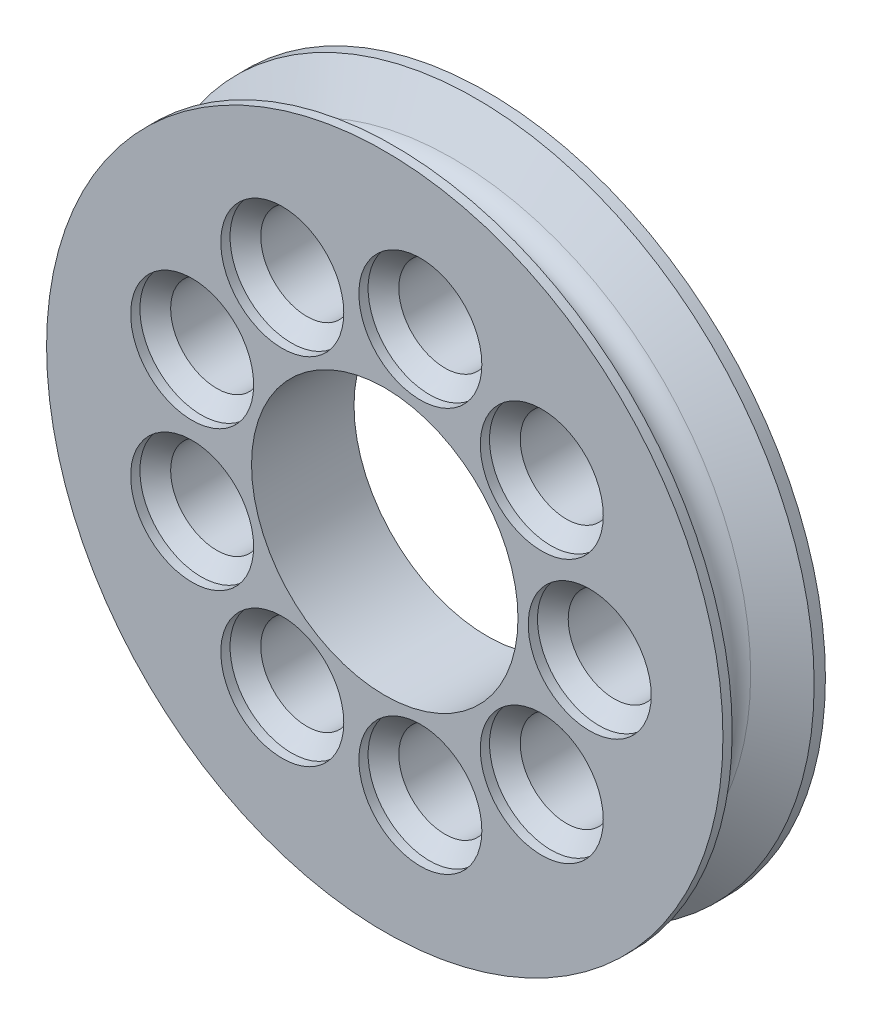
ISO-10303-21;
HEADER;
FILE_DESCRIPTION(('STEP AP214'),'2;1');
FILE_NAME('part.step','',(''),(''),'','','');
FILE_SCHEMA(('AUTOMOTIVE_DESIGN { 1 0 10303 214 1 1 1 1 }'));
ENDSEC;
DATA;
#1=APPLICATION_CONTEXT('core data for automotive mechanical design processes');
#2=APPLICATION_PROTOCOL_DEFINITION('international standard','automotive_design',2000,#1);
#3=PRODUCT_CONTEXT('',#1,'mechanical');
#4=PRODUCT('Part','Part','',(#3));
#5=PRODUCT_RELATED_PRODUCT_CATEGORY('part','',(#4));
#6=PRODUCT_DEFINITION_FORMATION('','',#4);
#7=PRODUCT_DEFINITION_CONTEXT('part definition',#1,'design');
#8=PRODUCT_DEFINITION('design','',#6,#7);
#9=PRODUCT_DEFINITION_SHAPE('','',#8);
#10=(LENGTH_UNIT() NAMED_UNIT(*) SI_UNIT(.MILLI.,.METRE.));
#11=(NAMED_UNIT(*) PLANE_ANGLE_UNIT() SI_UNIT($,.RADIAN.));
#12=(NAMED_UNIT(*) SI_UNIT($,.STERADIAN.) SOLID_ANGLE_UNIT());
#13=UNCERTAINTY_MEASURE_WITH_UNIT(LENGTH_MEASURE(1.E-05),#10,'distance_accuracy_value','');
#14=(GEOMETRIC_REPRESENTATION_CONTEXT(3) GLOBAL_UNCERTAINTY_ASSIGNED_CONTEXT((#13)) GLOBAL_UNIT_ASSIGNED_CONTEXT((#10,
#11,#12)) REPRESENTATION_CONTEXT('',''));
#15=CARTESIAN_POINT('',(0.,0.,0.));
#16=DIRECTION('',(0.,0.,1.));
#17=DIRECTION('',(1.,0.,0.));
#18=AXIS2_PLACEMENT_3D('',#15,#16,#17);
#19=CARTESIAN_POINT('',(41.91,0.,-11.5553001664477));
#20=DIRECTION('',(0.,0.,-1.));
#21=DIRECTION('',(-1.,0.,0.));
#22=AXIS2_PLACEMENT_3D('',#19,#20,#21);
#23=CYLINDRICAL_SURFACE('',#22,41.91);
#24=CARTESIAN_POINT('',(41.91,0.,1.14469983355232));
#25=DIRECTION('',(0.,0.,-1.));
#26=DIRECTION('',(-1.,0.,0.));
#27=AXIS2_PLACEMENT_3D('',#24,#25,#26);
#28=CIRCLE('',#27,41.91);
#29=CARTESIAN_POINT('',(0.,0.,1.14469983355232));
#30=VERTEX_POINT('',#29);
#31=EDGE_CURVE('E135',#30,#30,#28,.T.);
#32=ORIENTED_EDGE('',*,*,#31,.T.);
#33=EDGE_LOOP('',(#32));
#34=FACE_BOUND('',#33,.T.);
#35=CARTESIAN_POINT('',(41.91,0.,0.));
#36=DIRECTION('',(0.,0.,-1.));
#37=DIRECTION('',(-1.,0.,0.));
#38=AXIS2_PLACEMENT_3D('',#35,#36,#37);
#39=CIRCLE('',#38,41.91);
#40=CARTESIAN_POINT('',(0.,0.,0.));
#41=VERTEX_POINT('',#40);
#42=EDGE_CURVE('E10',#41,#41,#39,.T.);
#43=ORIENTED_EDGE('',*,*,#42,.F.);
#44=EDGE_LOOP('',(#43));
#45=FACE_BOUND('',#44,.T.);
#46=ADVANCED_FACE('F36',(#34,#45),#23,.T.);
#47=CARTESIAN_POINT('',(41.91,0.,-2.88029547438751));
#48=DIRECTION('',(0.,0.,1.));
#49=DIRECTION('',(1.,0.,0.));
#50=AXIS2_PLACEMENT_3D('',#47,#48,#49);
#51=CONICAL_SURFACE('',#50,36.9211818975501,1.0471975511966);
#52=ORIENTED_EDGE('',*,*,#42,.T.);
#53=EDGE_LOOP('',(#52));
#54=FACE_BOUND('',#53,.T.);
#55=CARTESIAN_POINT('',(41.91,0.,-2.88029547438751));
#56=DIRECTION('',(0.,0.,-1.));
#57=DIRECTION('',(-1.,0.,0.));
#58=AXIS2_PLACEMENT_3D('',#55,#56,#57);
#59=CIRCLE('',#58,36.9211818975501);
#60=CARTESIAN_POINT('',(4.98881810244987,0.,-2.88029547438751));
#61=VERTEX_POINT('',#60);
#62=EDGE_CURVE('E44',#61,#61,#59,.T.);
#63=ORIENTED_EDGE('',*,*,#62,.F.);
#64=EDGE_LOOP('',(#63));
#65=FACE_BOUND('',#64,.T.);
#66=ADVANCED_FACE('F155',(#54,#65),#51,.T.);
#67=CARTESIAN_POINT('',(41.91,0.,-5.08));
#68=DIRECTION('',(0.,0.,-1.));
#69=DIRECTION('',(-1.,0.,0.));
#70=AXIS2_PLACEMENT_3D('',#67,#68,#69);
#71=TOROIDAL_SURFACE('',#70,38.1911818975501,2.53999999999999);
#72=ORIENTED_EDGE('',*,*,#62,.T.);
#73=EDGE_LOOP('',(#72));
#74=FACE_BOUND('',#73,.T.);
#75=CARTESIAN_POINT('',(41.91,0.,-7.27970452561247));
#76=DIRECTION('',(0.,0.,-1.));
#77=DIRECTION('',(-1.,0.,0.));
#78=AXIS2_PLACEMENT_3D('',#75,#76,#77);
#79=CIRCLE('',#78,36.9211818975501);
#80=CARTESIAN_POINT('',(4.98881810244989,0.,-7.27970452561247));
#81=VERTEX_POINT('',#80);
#82=EDGE_CURVE('E50',#81,#81,#79,.T.);
#83=ORIENTED_EDGE('',*,*,#82,.F.);
#84=EDGE_LOOP('',(#83));
#85=FACE_BOUND('',#84,.T.);
#86=ADVANCED_FACE('F153',(#74,#85),#71,.F.);
#87=CARTESIAN_POINT('',(41.91,0.,-10.16));
#88=DIRECTION('',(0.,0.,-1.));
#89=DIRECTION('',(-1.,0.,0.));
#90=AXIS2_PLACEMENT_3D('',#87,#88,#89);
#91=CONICAL_SURFACE('',#90,41.91,1.0471975511966);
#92=ORIENTED_EDGE('',*,*,#82,.T.);
#93=EDGE_LOOP('',(#92));
#94=FACE_BOUND('',#93,.T.);
#95=CARTESIAN_POINT('',(41.91,0.,-10.16));
#96=DIRECTION('',(0.,0.,-1.));
#97=DIRECTION('',(-1.,0.,0.));
#98=AXIS2_PLACEMENT_3D('',#95,#96,#97);
#99=CIRCLE('',#98,41.91);
#100=CARTESIAN_POINT('',(0.,0.,-10.16));
#101=VERTEX_POINT('',#100);
#102=EDGE_CURVE('E143',#101,#101,#99,.T.);
#103=ORIENTED_EDGE('',*,*,#102,.F.);
#104=EDGE_LOOP('',(#103));
#105=FACE_BOUND('',#104,.T.);
#106=ADVANCED_FACE('F150',(#94,#105),#91,.T.);
#107=CARTESIAN_POINT('',(41.91,0.,-11.5553001664477));
#108=DIRECTION('',(0.,0.,-1.));
#109=DIRECTION('',(-1.,0.,0.));
#110=AXIS2_PLACEMENT_3D('',#107,#108,#109);
#111=CYLINDRICAL_SURFACE('',#110,41.91);
#112=ORIENTED_EDGE('',*,*,#102,.T.);
#113=EDGE_LOOP('',(#112));
#114=FACE_BOUND('',#113,.T.);
#115=CARTESIAN_POINT('',(41.91,0.,-11.5553001664477));
#116=DIRECTION('',(0.,0.,-1.));
#117=DIRECTION('',(-1.,0.,0.));
#118=AXIS2_PLACEMENT_3D('',#115,#116,#117);
#119=CIRCLE('',#118,41.91);
#120=CARTESIAN_POINT('',(0.,0.,-11.5553001664477));
#121=VERTEX_POINT('',#120);
#122=EDGE_CURVE('E139',#121,#121,#119,.T.);
#123=ORIENTED_EDGE('',*,*,#122,.F.);
#124=EDGE_LOOP('',(#123));
#125=FACE_BOUND('',#124,.T.);
#126=ADVANCED_FACE('F162',(#114,#125),#111,.T.);
#127=CARTESIAN_POINT('',(0.,0.,-11.5553001664477));
#128=DIRECTION('',(0.,0.,-1.));
#129=DIRECTION('',(-1.,0.,0.));
#130=AXIS2_PLACEMENT_3D('',#127,#128,#129);
#131=PLANE('',#130);
#132=CARTESIAN_POINT('',(46.32066371274,-25.0141169265101,-11.5553001664477));
#133=DIRECTION('',(0.,0.,-1.));
#134=DIRECTION('',(-1.,0.,0.));
#135=AXIS2_PLACEMENT_3D('',#132,#133,#134);
#136=CIRCLE('',#135,7.62);
#137=CARTESIAN_POINT('',(38.70066371274,-25.0141169265101,-11.5553001664477));
#138=VERTEX_POINT('',#137);
#139=EDGE_CURVE('E585',#138,#138,#136,.T.);
#140=ORIENTED_EDGE('',*,*,#139,.F.);
#141=EDGE_LOOP('',(#140));
#142=FACE_BOUND('',#141,.T.);
#143=CARTESIAN_POINT('',(61.367528855222,-16.3268052860381,-11.5553001664477));
#144=DIRECTION('',(0.,0.,-1.));
#145=DIRECTION('',(-1.,0.,0.));
#146=AXIS2_PLACEMENT_3D('',#143,#144,#145);
#147=CIRCLE('',#146,7.62);
#148=CARTESIAN_POINT('',(53.747528855222,-16.3268052860381,-11.5553001664477));
#149=VERTEX_POINT('',#148);
#150=EDGE_CURVE('E579',#149,#149,#147,.T.);
#151=ORIENTED_EDGE('',*,*,#150,.F.);
#152=EDGE_LOOP('',(#151));
#153=FACE_BOUND('',#152,.T.);
#154=CARTESIAN_POINT('',(18.0418074320379,-8.68731164047199,-11.5553001664477));
#155=DIRECTION('',(0.,0.,-1.));
#156=DIRECTION('',(-1.,0.,0.));
#157=AXIS2_PLACEMENT_3D('',#154,#155,#156);
#158=CIRCLE('',#157,7.62);
#159=CARTESIAN_POINT('',(10.4218074320379,-8.68731164047199,-11.5553001664477));
#160=VERTEX_POINT('',#159);
#161=EDGE_CURVE('E606',#160,#160,#158,.T.);
#162=ORIENTED_EDGE('',*,*,#161,.F.);
#163=EDGE_LOOP('',(#162));
#164=FACE_BOUND('',#163,.T.);
#165=CARTESIAN_POINT('',(29.21,-21.9970452561247,-11.5553001664477));
#166=DIRECTION('',(0.,0.,-1.));
#167=DIRECTION('',(-1.,0.,0.));
#168=AXIS2_PLACEMENT_3D('',#165,#166,#167);
#169=CIRCLE('',#168,7.62);
#170=CARTESIAN_POINT('',(21.59,-21.9970452561247,-11.5553001664477));
#171=VERTEX_POINT('',#170);
#172=EDGE_CURVE('E610',#171,#171,#169,.T.);
#173=ORIENTED_EDGE('',*,*,#172,.F.);
#174=EDGE_LOOP('',(#173));
#175=FACE_BOUND('',#174,.T.);
#176=CARTESIAN_POINT('',(29.21,21.9970452561247,-11.5553001664477));
#177=DIRECTION('',(0.,0.,-1.));
#178=DIRECTION('',(-1.,0.,0.));
#179=AXIS2_PLACEMENT_3D('',#176,#177,#178);
#180=CIRCLE('',#179,7.61999999999999);
#181=CARTESIAN_POINT('',(21.59,21.9970452561247,-11.5553001664477));
#182=VERTEX_POINT('',#181);
#183=EDGE_CURVE('E597',#182,#182,#180,.T.);
#184=ORIENTED_EDGE('',*,*,#183,.F.);
#185=EDGE_LOOP('',(#184));
#186=FACE_BOUND('',#185,.T.);
#187=CARTESIAN_POINT('',(18.0418074320379,8.68731164047199,-11.5553001664477));
#188=DIRECTION('',(0.,0.,-1.));
#189=DIRECTION('',(-1.,0.,0.));
#190=AXIS2_PLACEMENT_3D('',#187,#188,#189);
#191=CIRCLE('',#190,7.62);
#192=CARTESIAN_POINT('',(10.4218074320379,8.68731164047199,-11.5553001664477));
#193=VERTEX_POINT('',#192);
#194=EDGE_CURVE('E602',#193,#193,#191,.T.);
#195=ORIENTED_EDGE('',*,*,#194,.F.);
#196=EDGE_LOOP('',(#195));
#197=FACE_BOUND('',#196,.T.);
#198=CARTESIAN_POINT('',(61.367528855222,16.3268052860381,-11.5553001664477));
#199=DIRECTION('',(0.,0.,-1.));
#200=DIRECTION('',(-1.,0.,0.));
#201=AXIS2_PLACEMENT_3D('',#198,#199,#200);
#202=CIRCLE('',#201,7.62);
#203=CARTESIAN_POINT('',(53.747528855222,16.3268052860381,-11.5553001664477));
#204=VERTEX_POINT('',#203);
#205=EDGE_CURVE('E596',#204,#204,#202,.T.);
#206=ORIENTED_EDGE('',*,*,#205,.F.);
#207=EDGE_LOOP('',(#206));
#208=FACE_BOUND('',#207,.T.);
#209=CARTESIAN_POINT('',(46.32066371274,25.0141169265101,-11.5553001664477));
#210=DIRECTION('',(0.,0.,-1.));
#211=DIRECTION('',(-1.,0.,0.));
#212=AXIS2_PLACEMENT_3D('',#209,#210,#211);
#213=CIRCLE('',#212,7.62);
#214=CARTESIAN_POINT('',(38.70066371274,25.0141169265101,-11.5553001664477));
#215=VERTEX_POINT('',#214);
#216=EDGE_CURVE('E592',#215,#215,#213,.T.);
#217=ORIENTED_EDGE('',*,*,#216,.F.);
#218=EDGE_LOOP('',(#217));
#219=FACE_BOUND('',#218,.T.);
#220=CARTESIAN_POINT('',(67.31,0.,-11.5553001664477));
#221=DIRECTION('',(0.,0.,-1.));
#222=DIRECTION('',(-1.,0.,0.));
#223=AXIS2_PLACEMENT_3D('',#220,#221,#222);
#224=CIRCLE('',#223,7.62);
#225=CARTESIAN_POINT('',(59.69,0.,-11.5553001664477));
#226=VERTEX_POINT('',#225);
#227=EDGE_CURVE('E601',#226,#226,#224,.T.);
#228=ORIENTED_EDGE('',*,*,#227,.F.);
#229=EDGE_LOOP('',(#228));
#230=FACE_BOUND('',#229,.T.);
#231=CARTESIAN_POINT('',(41.91,0.,-11.5553001664477));
#232=DIRECTION('',(0.,0.,-1.));
#233=DIRECTION('',(-1.,0.,0.));
#234=AXIS2_PLACEMENT_3D('',#231,#232,#233);
#235=CIRCLE('',#234,16.51);
#236=CARTESIAN_POINT('',(25.4,0.,-11.5553001664477));
#237=VERTEX_POINT('',#236);
#238=EDGE_CURVE('E58',#237,#237,#235,.F.);
#239=ORIENTED_EDGE('',*,*,#238,.T.);
#240=EDGE_LOOP('',(#239));
#241=FACE_BOUND('',#240,.T.);
#242=ORIENTED_EDGE('',*,*,#122,.T.);
#243=EDGE_LOOP('',(#242));
#244=FACE_BOUND('',#243,.T.);
#245=ADVANCED_FACE('F173',(#142,#153,#164,#175,#186,#197,#208,#219,#230,#241,#244),#131,.T.);
#246=CARTESIAN_POINT('',(0.,0.,1.14469983355232));
#247=DIRECTION('',(0.,0.,1.));
#248=DIRECTION('',(1.,0.,0.));
#249=AXIS2_PLACEMENT_3D('',#246,#247,#248);
#250=PLANE('',#249);
#251=CARTESIAN_POINT('',(29.21,21.9970452561247,1.14469983355232));
#252=DIRECTION('',(0.,0.,1.));
#253=DIRECTION('',(1.,0.,0.));
#254=AXIS2_PLACEMENT_3D('',#251,#252,#253);
#255=CIRCLE('',#254,7.62);
#256=CARTESIAN_POINT('',(36.83,21.9970452561247,1.14469983355232));
#257=VERTEX_POINT('',#256);
#258=EDGE_CURVE('E39',#257,#257,#255,.F.);
#259=ORIENTED_EDGE('',*,*,#258,.T.);
#260=EDGE_LOOP('',(#259));
#261=FACE_BOUND('',#260,.T.);
#262=CARTESIAN_POINT('',(46.32066371274,25.0141169265101,1.14469983355232));
#263=DIRECTION('',(0.,0.,1.));
#264=DIRECTION('',(1.,0.,0.));
#265=AXIS2_PLACEMENT_3D('',#262,#263,#264);
#266=CIRCLE('',#265,7.62);
#267=CARTESIAN_POINT('',(53.94066371274,25.0141169265101,1.14469983355232));
#268=VERTEX_POINT('',#267);
#269=EDGE_CURVE('E87',#268,#268,#266,.F.);
#270=ORIENTED_EDGE('',*,*,#269,.T.);
#271=EDGE_LOOP('',(#270));
#272=FACE_BOUND('',#271,.T.);
#273=CARTESIAN_POINT('',(61.367528855222,16.3268052860381,1.14469983355232));
#274=DIRECTION('',(0.,0.,1.));
#275=DIRECTION('',(1.,0.,0.));
#276=AXIS2_PLACEMENT_3D('',#273,#274,#275);
#277=CIRCLE('',#276,7.62);
#278=CARTESIAN_POINT('',(68.987528855222,16.3268052860381,1.14469983355232));
#279=VERTEX_POINT('',#278);
#280=EDGE_CURVE('E84',#279,#279,#277,.F.);
#281=ORIENTED_EDGE('',*,*,#280,.T.);
#282=EDGE_LOOP('',(#281));
#283=FACE_BOUND('',#282,.T.);
#284=CARTESIAN_POINT('',(61.367528855222,-16.3268052860381,1.14469983355232));
#285=DIRECTION('',(0.,0.,1.));
#286=DIRECTION('',(1.,0.,0.));
#287=AXIS2_PLACEMENT_3D('',#284,#285,#286);
#288=CIRCLE('',#287,7.62);
#289=CARTESIAN_POINT('',(68.987528855222,-16.3268052860381,1.14469983355232));
#290=VERTEX_POINT('',#289);
#291=EDGE_CURVE('E80',#290,#290,#288,.F.);
#292=ORIENTED_EDGE('',*,*,#291,.T.);
#293=EDGE_LOOP('',(#292));
#294=FACE_BOUND('',#293,.T.);
#295=CARTESIAN_POINT('',(46.32066371274,-25.0141169265101,1.14469983355232));
#296=DIRECTION('',(0.,0.,1.));
#297=DIRECTION('',(1.,0.,0.));
#298=AXIS2_PLACEMENT_3D('',#295,#296,#297);
#299=CIRCLE('',#298,7.62);
#300=CARTESIAN_POINT('',(53.94066371274,-25.0141169265101,1.14469983355232));
#301=VERTEX_POINT('',#300);
#302=EDGE_CURVE('E76',#301,#301,#299,.F.);
#303=ORIENTED_EDGE('',*,*,#302,.T.);
#304=EDGE_LOOP('',(#303));
#305=FACE_BOUND('',#304,.T.);
#306=CARTESIAN_POINT('',(29.21,-21.9970452561247,1.14469983355232));
#307=DIRECTION('',(0.,0.,1.));
#308=DIRECTION('',(1.,0.,0.));
#309=AXIS2_PLACEMENT_3D('',#306,#307,#308);
#310=CIRCLE('',#309,7.61999999999999);
#311=CARTESIAN_POINT('',(36.83,-21.9970452561247,1.14469983355232));
#312=VERTEX_POINT('',#311);
#313=EDGE_CURVE('E72',#312,#312,#310,.F.);
#314=ORIENTED_EDGE('',*,*,#313,.T.);
#315=EDGE_LOOP('',(#314));
#316=FACE_BOUND('',#315,.T.);
#317=CARTESIAN_POINT('',(18.0418074320379,-8.68731164047199,1.14469983355232));
#318=DIRECTION('',(0.,0.,1.));
#319=DIRECTION('',(1.,0.,0.));
#320=AXIS2_PLACEMENT_3D('',#317,#318,#319);
#321=CIRCLE('',#320,7.62);
#322=CARTESIAN_POINT('',(25.6618074320379,-8.68731164047199,1.14469983355232));
#323=VERTEX_POINT('',#322);
#324=EDGE_CURVE('E68',#323,#323,#321,.F.);
#325=ORIENTED_EDGE('',*,*,#324,.T.);
#326=EDGE_LOOP('',(#325));
#327=FACE_BOUND('',#326,.T.);
#328=CARTESIAN_POINT('',(18.0418074320379,8.68731164047199,1.14469983355232));
#329=DIRECTION('',(0.,0.,1.));
#330=DIRECTION('',(1.,0.,0.));
#331=AXIS2_PLACEMENT_3D('',#328,#329,#330);
#332=CIRCLE('',#331,7.62);
#333=CARTESIAN_POINT('',(25.6618074320379,8.68731164047199,1.14469983355232));
#334=VERTEX_POINT('',#333);
#335=EDGE_CURVE('E63',#334,#334,#332,.F.);
#336=ORIENTED_EDGE('',*,*,#335,.T.);
#337=EDGE_LOOP('',(#336));
#338=FACE_BOUND('',#337,.T.);
#339=CARTESIAN_POINT('',(67.31,0.,1.14469983355232));
#340=DIRECTION('',(0.,0.,1.));
#341=DIRECTION('',(1.,0.,0.));
#342=AXIS2_PLACEMENT_3D('',#339,#340,#341);
#343=CIRCLE('',#342,7.62);
#344=CARTESIAN_POINT('',(74.93,0.,1.14469983355232));
#345=VERTEX_POINT('',#344);
#346=EDGE_CURVE('E59',#345,#345,#343,.F.);
#347=ORIENTED_EDGE('',*,*,#346,.T.);
#348=EDGE_LOOP('',(#347));
#349=FACE_BOUND('',#348,.T.);
#350=CARTESIAN_POINT('',(41.91,0.,1.14469983355232));
#351=DIRECTION('',(0.,0.,1.));
#352=DIRECTION('',(1.,0.,0.));
#353=AXIS2_PLACEMENT_3D('',#350,#351,#352);
#354=CIRCLE('',#353,16.51);
#355=CARTESIAN_POINT('',(58.42,0.,1.14469983355232));
#356=VERTEX_POINT('',#355);
#357=EDGE_CURVE('E54',#356,#356,#354,.F.);
#358=ORIENTED_EDGE('',*,*,#357,.T.);
#359=EDGE_LOOP('',(#358));
#360=FACE_BOUND('',#359,.T.);
#361=ORIENTED_EDGE('',*,*,#31,.F.);
#362=EDGE_LOOP('',(#361));
#363=FACE_BOUND('',#362,.T.);
#364=ADVANCED_FACE('F96',(#261,#272,#283,#294,#305,#316,#327,#338,#349,#360,#363),#250,.T.);
#365=CARTESIAN_POINT('',(41.91,0.,20.4486998335523));
#366=DIRECTION('',(0.,0.,-1.));
#367=DIRECTION('',(-1.,0.,0.));
#368=AXIS2_PLACEMENT_3D('',#365,#366,#367);
#369=CYLINDRICAL_SURFACE('',#368,16.51);
#370=ORIENTED_EDGE('',*,*,#238,.F.);
#371=EDGE_LOOP('',(#370));
#372=FACE_BOUND('',#371,.T.);
#373=ORIENTED_EDGE('',*,*,#357,.F.);
#374=EDGE_LOOP('',(#373));
#375=FACE_BOUND('',#374,.T.);
#376=ADVANCED_FACE('F172',(#372,#375),#369,.F.);
#377=CARTESIAN_POINT('',(67.31,0.,9.398));
#378=DIRECTION('',(0.,0.,-1.));
#379=DIRECTION('',(-1.,0.,0.));
#380=AXIS2_PLACEMENT_3D('',#377,#378,#379);
#381=CYLINDRICAL_SURFACE('',#380,7.62);
#382=ORIENTED_EDGE('',*,*,#346,.F.);
#383=EDGE_LOOP('',(#382));
#384=FACE_BOUND('',#383,.T.);
#385=CARTESIAN_POINT('',(67.31,0.,0.));
#386=DIRECTION('',(0.,0.,1.));
#387=DIRECTION('',(1.,0.,0.));
#388=AXIS2_PLACEMENT_3D('',#385,#386,#387);
#389=CIRCLE('',#388,7.62);
#390=CARTESIAN_POINT('',(74.93,0.,0.));
#391=VERTEX_POINT('',#390);
#392=EDGE_CURVE('E64',#391,#391,#389,.T.);
#393=ORIENTED_EDGE('',*,*,#392,.F.);
#394=EDGE_LOOP('',(#393));
#395=FACE_BOUND('',#394,.T.);
#396=ADVANCED_FACE('F179',(#384,#395),#381,.F.);
#397=CARTESIAN_POINT('',(67.31,0.,0.));
#398=DIRECTION('',(0.,0.,1.));
#399=DIRECTION('',(1.,0.,0.));
#400=AXIS2_PLACEMENT_3D('',#397,#398,#399);
#401=CONICAL_SURFACE('',#400,7.62,0.78539816339745);
#402=CARTESIAN_POINT('',(67.31,0.,-1.905));
#403=DIRECTION('',(0.,0.,1.));
#404=DIRECTION('',(1.,0.,0.));
#405=AXIS2_PLACEMENT_3D('',#402,#403,#404);
#406=CIRCLE('',#405,5.71500000000001);
#407=CARTESIAN_POINT('',(73.025,0.,-1.905));
#408=VERTEX_POINT('',#407);
#409=EDGE_CURVE('E577',#408,#408,#406,.F.);
#410=ORIENTED_EDGE('',*,*,#409,.T.);
#411=EDGE_LOOP('',(#410));
#412=FACE_BOUND('',#411,.T.);
#413=ORIENTED_EDGE('',*,*,#392,.T.);
#414=EDGE_LOOP('',(#413));
#415=FACE_BOUND('',#414,.T.);
#416=ADVANCED_FACE('F420',(#412,#415),#401,.F.);
#417=CARTESIAN_POINT('',(18.0418074320379,8.68731164047199,9.398));
#418=DIRECTION('',(0.,0.,-1.));
#419=DIRECTION('',(-1.,0.,0.));
#420=AXIS2_PLACEMENT_3D('',#417,#418,#419);
#421=CYLINDRICAL_SURFACE('',#420,7.62);
#422=ORIENTED_EDGE('',*,*,#335,.F.);
#423=EDGE_LOOP('',(#422));
#424=FACE_BOUND('',#423,.T.);
#425=CARTESIAN_POINT('',(18.0418074320379,8.68731164047199,0.));
#426=DIRECTION('',(0.,0.,1.));
#427=DIRECTION('',(1.,0.,0.));
#428=AXIS2_PLACEMENT_3D('',#425,#426,#427);
#429=CIRCLE('',#428,7.62);
#430=CARTESIAN_POINT('',(25.6618074320379,8.68731164047199,0.));
#431=VERTEX_POINT('',#430);
#432=EDGE_CURVE('E110',#431,#431,#429,.T.);
#433=ORIENTED_EDGE('',*,*,#432,.F.);
#434=EDGE_LOOP('',(#433));
#435=FACE_BOUND('',#434,.T.);
#436=ADVANCED_FACE('F416',(#424,#435),#421,.F.);
#437=CARTESIAN_POINT('',(18.0418074320379,8.68731164047199,0.));
#438=DIRECTION('',(0.,0.,1.));
#439=DIRECTION('',(1.,0.,0.));
#440=AXIS2_PLACEMENT_3D('',#437,#438,#439);
#441=CONICAL_SURFACE('',#440,7.62,0.78539816339745);
#442=CARTESIAN_POINT('',(18.0418074320379,8.68731164047199,-1.905));
#443=DIRECTION('',(0.,0.,1.));
#444=DIRECTION('',(1.,0.,0.));
#445=AXIS2_PLACEMENT_3D('',#442,#443,#444);
#446=CIRCLE('',#445,5.71499999999999);
#447=CARTESIAN_POINT('',(23.7568074320379,8.68731164047199,-1.905));
#448=VERTEX_POINT('',#447);
#449=EDGE_CURVE('E684',#448,#448,#446,.F.);
#450=ORIENTED_EDGE('',*,*,#449,.T.);
#451=EDGE_LOOP('',(#450));
#452=FACE_BOUND('',#451,.T.);
#453=ORIENTED_EDGE('',*,*,#432,.T.);
#454=EDGE_LOOP('',(#453));
#455=FACE_BOUND('',#454,.T.);
#456=ADVANCED_FACE('F412',(#452,#455),#441,.F.);
#457=CARTESIAN_POINT('',(18.0418074320379,-8.68731164047199,9.398));
#458=DIRECTION('',(0.,0.,-1.));
#459=DIRECTION('',(-1.,0.,0.));
#460=AXIS2_PLACEMENT_3D('',#457,#458,#459);
#461=CYLINDRICAL_SURFACE('',#460,7.62);
#462=ORIENTED_EDGE('',*,*,#324,.F.);
#463=EDGE_LOOP('',(#462));
#464=FACE_BOUND('',#463,.T.);
#465=CARTESIAN_POINT('',(18.0418074320379,-8.68731164047199,0.));
#466=DIRECTION('',(0.,0.,1.));
#467=DIRECTION('',(1.,0.,0.));
#468=AXIS2_PLACEMENT_3D('',#465,#466,#467);
#469=CIRCLE('',#468,7.62);
#470=CARTESIAN_POINT('',(25.6618074320379,-8.68731164047199,0.));
#471=VERTEX_POINT('',#470);
#472=EDGE_CURVE('E118',#471,#471,#469,.T.);
#473=ORIENTED_EDGE('',*,*,#472,.F.);
#474=EDGE_LOOP('',(#473));
#475=FACE_BOUND('',#474,.T.);
#476=ADVANCED_FACE('F415',(#464,#475),#461,.F.);
#477=CARTESIAN_POINT('',(18.0418074320379,-8.68731164047199,0.));
#478=DIRECTION('',(0.,0.,1.));
#479=DIRECTION('',(1.,0.,0.));
#480=AXIS2_PLACEMENT_3D('',#477,#478,#479);
#481=CONICAL_SURFACE('',#480,7.62,0.78539816339745);
#482=CARTESIAN_POINT('',(18.0418074320379,-8.68731164047199,-1.905));
#483=DIRECTION('',(0.,0.,1.));
#484=DIRECTION('',(1.,0.,0.));
#485=AXIS2_PLACEMENT_3D('',#482,#483,#484);
#486=CIRCLE('',#485,5.71499999999999);
#487=CARTESIAN_POINT('',(23.7568074320379,-8.68731164047199,-1.905));
#488=VERTEX_POINT('',#487);
#489=EDGE_CURVE('E708',#488,#488,#486,.F.);
#490=ORIENTED_EDGE('',*,*,#489,.T.);
#491=EDGE_LOOP('',(#490));
#492=FACE_BOUND('',#491,.T.);
#493=ORIENTED_EDGE('',*,*,#472,.T.);
#494=EDGE_LOOP('',(#493));
#495=FACE_BOUND('',#494,.T.);
#496=ADVANCED_FACE('F402',(#492,#495),#481,.F.);
#497=CARTESIAN_POINT('',(29.21,-21.9970452561247,9.398));
#498=DIRECTION('',(0.,0.,-1.));
#499=DIRECTION('',(-1.,0.,0.));
#500=AXIS2_PLACEMENT_3D('',#497,#498,#499);
#501=CYLINDRICAL_SURFACE('',#500,7.61999999999999);
#502=ORIENTED_EDGE('',*,*,#313,.F.);
#503=EDGE_LOOP('',(#502));
#504=FACE_BOUND('',#503,.T.);
#505=CARTESIAN_POINT('',(29.21,-21.9970452561247,0.));
#506=DIRECTION('',(0.,0.,1.));
#507=DIRECTION('',(1.,0.,0.));
#508=AXIS2_PLACEMENT_3D('',#505,#506,#507);
#509=CIRCLE('',#508,7.61999999999999);
#510=CARTESIAN_POINT('',(36.83,-21.9970452561247,0.));
#511=VERTEX_POINT('',#510);
#512=EDGE_CURVE('E624',#511,#511,#509,.T.);
#513=ORIENTED_EDGE('',*,*,#512,.F.);
#514=EDGE_LOOP('',(#513));
#515=FACE_BOUND('',#514,.T.);
#516=ADVANCED_FACE('F398',(#504,#515),#501,.F.);
#517=CARTESIAN_POINT('',(29.21,-21.9970452561247,0.));
#518=DIRECTION('',(0.,0.,1.));
#519=DIRECTION('',(1.,0.,0.));
#520=AXIS2_PLACEMENT_3D('',#517,#518,#519);
#521=CONICAL_SURFACE('',#520,7.61999999999999,0.78539816339745);
#522=CARTESIAN_POINT('',(29.21,-21.9970452561247,-1.905));
#523=DIRECTION('',(0.,0.,1.));
#524=DIRECTION('',(1.,0.,0.));
#525=AXIS2_PLACEMENT_3D('',#522,#523,#524);
#526=CIRCLE('',#525,5.715);
#527=CARTESIAN_POINT('',(34.925,-21.9970452561247,-1.905));
#528=VERTEX_POINT('',#527);
#529=EDGE_CURVE('E700',#528,#528,#526,.F.);
#530=ORIENTED_EDGE('',*,*,#529,.T.);
#531=EDGE_LOOP('',(#530));
#532=FACE_BOUND('',#531,.T.);
#533=ORIENTED_EDGE('',*,*,#512,.T.);
#534=EDGE_LOOP('',(#533));
#535=FACE_BOUND('',#534,.T.);
#536=ADVANCED_FACE('F394',(#532,#535),#521,.F.);
#537=CARTESIAN_POINT('',(46.32066371274,-25.0141169265101,9.398));
#538=DIRECTION('',(0.,0.,-1.));
#539=DIRECTION('',(-1.,0.,0.));
#540=AXIS2_PLACEMENT_3D('',#537,#538,#539);
#541=CYLINDRICAL_SURFACE('',#540,7.62);
#542=ORIENTED_EDGE('',*,*,#302,.F.);
#543=EDGE_LOOP('',(#542));
#544=FACE_BOUND('',#543,.T.);
#545=CARTESIAN_POINT('',(46.32066371274,-25.0141169265101,0.));
#546=DIRECTION('',(0.,0.,1.));
#547=DIRECTION('',(1.,0.,0.));
#548=AXIS2_PLACEMENT_3D('',#545,#546,#547);
#549=CIRCLE('',#548,7.62);
#550=CARTESIAN_POINT('',(53.94066371274,-25.0141169265101,0.));
#551=VERTEX_POINT('',#550);
#552=EDGE_CURVE('E623',#551,#551,#549,.T.);
#553=ORIENTED_EDGE('',*,*,#552,.F.);
#554=EDGE_LOOP('',(#553));
#555=FACE_BOUND('',#554,.T.);
#556=ADVANCED_FACE('F397',(#544,#555),#541,.F.);
#557=CARTESIAN_POINT('',(46.32066371274,-25.0141169265101,0.));
#558=DIRECTION('',(0.,0.,1.));
#559=DIRECTION('',(1.,0.,0.));
#560=AXIS2_PLACEMENT_3D('',#557,#558,#559);
#561=CONICAL_SURFACE('',#560,7.62,0.78539816339745);
#562=CARTESIAN_POINT('',(46.32066371274,-25.0141169265101,-1.905));
#563=DIRECTION('',(0.,0.,1.));
#564=DIRECTION('',(1.,0.,0.));
#565=AXIS2_PLACEMENT_3D('',#562,#563,#564);
#566=CIRCLE('',#565,5.71499999999999);
#567=CARTESIAN_POINT('',(52.03566371274,-25.0141169265101,-1.905));
#568=VERTEX_POINT('',#567);
#569=EDGE_CURVE('E724',#568,#568,#566,.F.);
#570=ORIENTED_EDGE('',*,*,#569,.T.);
#571=EDGE_LOOP('',(#570));
#572=FACE_BOUND('',#571,.T.);
#573=ORIENTED_EDGE('',*,*,#552,.T.);
#574=EDGE_LOOP('',(#573));
#575=FACE_BOUND('',#574,.T.);
#576=ADVANCED_FACE('F404',(#572,#575),#561,.F.);
#577=CARTESIAN_POINT('',(61.367528855222,-16.3268052860381,9.398));
#578=DIRECTION('',(0.,0.,-1.));
#579=DIRECTION('',(-1.,0.,0.));
#580=AXIS2_PLACEMENT_3D('',#577,#578,#579);
#581=CYLINDRICAL_SURFACE('',#580,7.62);
#582=ORIENTED_EDGE('',*,*,#291,.F.);
#583=EDGE_LOOP('',(#582));
#584=FACE_BOUND('',#583,.T.);
#585=CARTESIAN_POINT('',(61.367528855222,-16.3268052860381,0.));
#586=DIRECTION('',(0.,0.,1.));
#587=DIRECTION('',(1.,0.,0.));
#588=AXIS2_PLACEMENT_3D('',#585,#586,#587);
#589=CIRCLE('',#588,7.62);
#590=CARTESIAN_POINT('',(68.987528855222,-16.3268052860381,0.));
#591=VERTEX_POINT('',#590);
#592=EDGE_CURVE('E122',#591,#591,#589,.T.);
#593=ORIENTED_EDGE('',*,*,#592,.F.);
#594=EDGE_LOOP('',(#593));
#595=FACE_BOUND('',#594,.T.);
#596=ADVANCED_FACE('F407',(#584,#595),#581,.F.);
#597=CARTESIAN_POINT('',(61.367528855222,-16.3268052860381,0.));
#598=DIRECTION('',(0.,0.,1.));
#599=DIRECTION('',(1.,0.,0.));
#600=AXIS2_PLACEMENT_3D('',#597,#598,#599);
#601=CONICAL_SURFACE('',#600,7.62,0.78539816339745);
#602=CARTESIAN_POINT('',(61.367528855222,-16.3268052860381,-1.905));
#603=DIRECTION('',(0.,0.,1.));
#604=DIRECTION('',(1.,0.,0.));
#605=AXIS2_PLACEMENT_3D('',#602,#603,#604);
#606=CIRCLE('',#605,5.71499999999999);
#607=CARTESIAN_POINT('',(67.082528855222,-16.3268052860381,-1.905));
#608=VERTEX_POINT('',#607);
#609=EDGE_CURVE('E716',#608,#608,#606,.F.);
#610=ORIENTED_EDGE('',*,*,#609,.T.);
#611=EDGE_LOOP('',(#610));
#612=FACE_BOUND('',#611,.T.);
#613=ORIENTED_EDGE('',*,*,#592,.T.);
#614=EDGE_LOOP('',(#613));
#615=FACE_BOUND('',#614,.T.);
#616=ADVANCED_FACE('F438',(#612,#615),#601,.F.);
#617=CARTESIAN_POINT('',(61.367528855222,16.3268052860381,9.398));
#618=DIRECTION('',(0.,0.,-1.));
#619=DIRECTION('',(-1.,0.,0.));
#620=AXIS2_PLACEMENT_3D('',#617,#618,#619);
#621=CYLINDRICAL_SURFACE('',#620,7.62);
#622=ORIENTED_EDGE('',*,*,#280,.F.);
#623=EDGE_LOOP('',(#622));
#624=FACE_BOUND('',#623,.T.);
#625=CARTESIAN_POINT('',(61.367528855222,16.3268052860381,0.));
#626=DIRECTION('',(0.,0.,1.));
#627=DIRECTION('',(1.,0.,0.));
#628=AXIS2_PLACEMENT_3D('',#625,#626,#627);
#629=CIRCLE('',#628,7.62);
#630=CARTESIAN_POINT('',(68.987528855222,16.3268052860381,0.));
#631=VERTEX_POINT('',#630);
#632=EDGE_CURVE('E115',#631,#631,#629,.T.);
#633=ORIENTED_EDGE('',*,*,#632,.F.);
#634=EDGE_LOOP('',(#633));
#635=FACE_BOUND('',#634,.T.);
#636=ADVANCED_FACE('F441',(#624,#635),#621,.F.);
#637=CARTESIAN_POINT('',(61.367528855222,16.3268052860381,0.));
#638=DIRECTION('',(0.,0.,1.));
#639=DIRECTION('',(1.,0.,0.));
#640=AXIS2_PLACEMENT_3D('',#637,#638,#639);
#641=CONICAL_SURFACE('',#640,7.62,0.78539816339745);
#642=CARTESIAN_POINT('',(61.367528855222,16.3268052860381,-1.905));
#643=DIRECTION('',(0.,0.,1.));
#644=DIRECTION('',(1.,0.,0.));
#645=AXIS2_PLACEMENT_3D('',#642,#643,#644);
#646=CIRCLE('',#645,5.71500000000001);
#647=CARTESIAN_POINT('',(67.0825288552221,16.3268052860381,-1.905));
#648=VERTEX_POINT('',#647);
#649=EDGE_CURVE('E676',#648,#648,#646,.F.);
#650=ORIENTED_EDGE('',*,*,#649,.T.);
#651=EDGE_LOOP('',(#650));
#652=FACE_BOUND('',#651,.T.);
#653=ORIENTED_EDGE('',*,*,#632,.T.);
#654=EDGE_LOOP('',(#653));
#655=FACE_BOUND('',#654,.T.);
#656=ADVANCED_FACE('F434',(#652,#655),#641,.F.);
#657=CARTESIAN_POINT('',(46.32066371274,25.0141169265101,9.398));
#658=DIRECTION('',(0.,0.,-1.));
#659=DIRECTION('',(-1.,0.,0.));
#660=AXIS2_PLACEMENT_3D('',#657,#658,#659);
#661=CYLINDRICAL_SURFACE('',#660,7.62);
#662=ORIENTED_EDGE('',*,*,#269,.F.);
#663=EDGE_LOOP('',(#662));
#664=FACE_BOUND('',#663,.T.);
#665=CARTESIAN_POINT('',(46.32066371274,25.0141169265101,0.));
#666=DIRECTION('',(0.,0.,1.));
#667=DIRECTION('',(1.,0.,0.));
#668=AXIS2_PLACEMENT_3D('',#665,#666,#667);
#669=CIRCLE('',#668,7.62);
#670=CARTESIAN_POINT('',(53.94066371274,25.0141169265101,0.));
#671=VERTEX_POINT('',#670);
#672=EDGE_CURVE('E109',#671,#671,#669,.T.);
#673=ORIENTED_EDGE('',*,*,#672,.F.);
#674=EDGE_LOOP('',(#673));
#675=FACE_BOUND('',#674,.T.);
#676=ADVANCED_FACE('F430',(#664,#675),#661,.F.);
#677=CARTESIAN_POINT('',(46.32066371274,25.0141169265101,0.));
#678=DIRECTION('',(0.,0.,1.));
#679=DIRECTION('',(1.,0.,0.));
#680=AXIS2_PLACEMENT_3D('',#677,#678,#679);
#681=CONICAL_SURFACE('',#680,7.62,0.78539816339745);
#682=CARTESIAN_POINT('',(46.32066371274,25.0141169265101,-1.905));
#683=DIRECTION('',(0.,0.,1.));
#684=DIRECTION('',(1.,0.,0.));
#685=AXIS2_PLACEMENT_3D('',#682,#683,#684);
#686=CIRCLE('',#685,5.71499999999999);
#687=CARTESIAN_POINT('',(52.03566371274,25.0141169265101,-1.905));
#688=VERTEX_POINT('',#687);
#689=EDGE_CURVE('E588',#688,#688,#686,.F.);
#690=ORIENTED_EDGE('',*,*,#689,.T.);
#691=EDGE_LOOP('',(#690));
#692=FACE_BOUND('',#691,.T.);
#693=ORIENTED_EDGE('',*,*,#672,.T.);
#694=EDGE_LOOP('',(#693));
#695=FACE_BOUND('',#694,.T.);
#696=ADVANCED_FACE('F102',(#692,#695),#681,.F.);
#697=CARTESIAN_POINT('',(29.21,21.9970452561247,9.398));
#698=DIRECTION('',(0.,0.,-1.));
#699=DIRECTION('',(-1.,0.,0.));
#700=AXIS2_PLACEMENT_3D('',#697,#698,#699);
#701=CYLINDRICAL_SURFACE('',#700,7.62);
#702=ORIENTED_EDGE('',*,*,#258,.F.);
#703=EDGE_LOOP('',(#702));
#704=FACE_BOUND('',#703,.T.);
#705=CARTESIAN_POINT('',(29.21,21.9970452561247,0.));
#706=DIRECTION('',(0.,0.,1.));
#707=DIRECTION('',(1.,0.,0.));
#708=AXIS2_PLACEMENT_3D('',#705,#706,#707);
#709=CIRCLE('',#708,7.62);
#710=CARTESIAN_POINT('',(36.83,21.9970452561247,0.));
#711=VERTEX_POINT('',#710);
#712=EDGE_CURVE('E106',#711,#711,#709,.T.);
#713=ORIENTED_EDGE('',*,*,#712,.F.);
#714=EDGE_LOOP('',(#713));
#715=FACE_BOUND('',#714,.T.);
#716=ADVANCED_FACE('F98',(#704,#715),#701,.F.);
#717=CARTESIAN_POINT('',(29.21,21.9970452561247,0.));
#718=DIRECTION('',(0.,0.,1.));
#719=DIRECTION('',(1.,0.,0.));
#720=AXIS2_PLACEMENT_3D('',#717,#718,#719);
#721=CONICAL_SURFACE('',#720,7.62,0.78539816339745);
#722=CARTESIAN_POINT('',(29.21,21.9970452561247,-1.905));
#723=DIRECTION('',(0.,0.,1.));
#724=DIRECTION('',(1.,0.,0.));
#725=AXIS2_PLACEMENT_3D('',#722,#723,#724);
#726=CIRCLE('',#725,5.71499999999999);
#727=CARTESIAN_POINT('',(34.925,21.9970452561247,-1.905));
#728=VERTEX_POINT('',#727);
#729=EDGE_CURVE('E692',#728,#728,#726,.F.);
#730=ORIENTED_EDGE('',*,*,#729,.T.);
#731=EDGE_LOOP('',(#730));
#732=FACE_BOUND('',#731,.T.);
#733=ORIENTED_EDGE('',*,*,#712,.T.);
#734=EDGE_LOOP('',(#733));
#735=FACE_BOUND('',#734,.T.);
#736=ADVANCED_FACE('F101',(#732,#735),#721,.F.);
#737=CARTESIAN_POINT('',(67.31,0.,-11.5553001664477));
#738=DIRECTION('',(0.,0.,-1.));
#739=DIRECTION('',(-1.,0.,0.));
#740=AXIS2_PLACEMENT_3D('',#737,#738,#739);
#741=CONICAL_SURFACE('',#740,7.62,0.78539816339745);
#742=CARTESIAN_POINT('',(67.31,0.,-9.65030016644767));
#743=DIRECTION('',(0.,0.,-1.));
#744=DIRECTION('',(-1.,0.,0.));
#745=AXIS2_PLACEMENT_3D('',#742,#743,#744);
#746=CIRCLE('',#745,5.71500000000001);
#747=CARTESIAN_POINT('',(61.595,0.,-9.65030016644767));
#748=VERTEX_POINT('',#747);
#749=EDGE_CURVE('E580',#748,#748,#746,.F.);
#750=ORIENTED_EDGE('',*,*,#749,.T.);
#751=EDGE_LOOP('',(#750));
#752=FACE_BOUND('',#751,.T.);
#753=ORIENTED_EDGE('',*,*,#227,.T.);
#754=EDGE_LOOP('',(#753));
#755=FACE_BOUND('',#754,.T.);
#756=ADVANCED_FACE('F212',(#752,#755),#741,.F.);
#757=CARTESIAN_POINT('',(46.32066371274,25.0141169265101,-11.5553001664477));
#758=DIRECTION('',(0.,0.,-1.));
#759=DIRECTION('',(-1.,0.,0.));
#760=AXIS2_PLACEMENT_3D('',#757,#758,#759);
#761=CONICAL_SURFACE('',#760,7.62,0.78539816339745);
#762=CARTESIAN_POINT('',(46.32066371274,25.0141169265101,-9.65030016644767));
#763=DIRECTION('',(0.,0.,-1.));
#764=DIRECTION('',(-1.,0.,0.));
#765=AXIS2_PLACEMENT_3D('',#762,#763,#764);
#766=CIRCLE('',#765,5.71499999999999);
#767=CARTESIAN_POINT('',(40.60566371274,25.0141169265101,-9.65030016644767));
#768=VERTEX_POINT('',#767);
#769=EDGE_CURVE('E672',#768,#768,#766,.F.);
#770=ORIENTED_EDGE('',*,*,#769,.T.);
#771=EDGE_LOOP('',(#770));
#772=FACE_BOUND('',#771,.T.);
#773=ORIENTED_EDGE('',*,*,#216,.T.);
#774=EDGE_LOOP('',(#773));
#775=FACE_BOUND('',#774,.T.);
#776=ADVANCED_FACE('F217',(#772,#775),#761,.F.);
#777=CARTESIAN_POINT('',(61.367528855222,16.3268052860381,-11.5553001664477));
#778=DIRECTION('',(0.,0.,-1.));
#779=DIRECTION('',(-1.,0.,0.));
#780=AXIS2_PLACEMENT_3D('',#777,#778,#779);
#781=CONICAL_SURFACE('',#780,7.62,0.78539816339745);
#782=CARTESIAN_POINT('',(61.367528855222,16.3268052860381,-9.65030016644767));
#783=DIRECTION('',(0.,0.,-1.));
#784=DIRECTION('',(-1.,0.,0.));
#785=AXIS2_PLACEMENT_3D('',#782,#783,#784);
#786=CIRCLE('',#785,5.71500000000001);
#787=CARTESIAN_POINT('',(55.652528855222,16.3268052860381,-9.65030016644767));
#788=VERTEX_POINT('',#787);
#789=EDGE_CURVE('E680',#788,#788,#786,.F.);
#790=ORIENTED_EDGE('',*,*,#789,.T.);
#791=EDGE_LOOP('',(#790));
#792=FACE_BOUND('',#791,.T.);
#793=ORIENTED_EDGE('',*,*,#205,.T.);
#794=EDGE_LOOP('',(#793));
#795=FACE_BOUND('',#794,.T.);
#796=ADVANCED_FACE('F227',(#792,#795),#781,.F.);
#797=CARTESIAN_POINT('',(18.0418074320379,8.68731164047199,-11.5553001664477));
#798=DIRECTION('',(0.,0.,-1.));
#799=DIRECTION('',(-1.,0.,0.));
#800=AXIS2_PLACEMENT_3D('',#797,#798,#799);
#801=CONICAL_SURFACE('',#800,7.62,0.78539816339745);
#802=CARTESIAN_POINT('',(18.0418074320379,8.68731164047199,-9.65030016644767));
#803=DIRECTION('',(0.,0.,-1.));
#804=DIRECTION('',(-1.,0.,0.));
#805=AXIS2_PLACEMENT_3D('',#802,#803,#804);
#806=CIRCLE('',#805,5.71499999999999);
#807=CARTESIAN_POINT('',(12.3268074320379,8.68731164047199,-9.65030016644767));
#808=VERTEX_POINT('',#807);
#809=EDGE_CURVE('E688',#808,#808,#806,.F.);
#810=ORIENTED_EDGE('',*,*,#809,.T.);
#811=EDGE_LOOP('',(#810));
#812=FACE_BOUND('',#811,.T.);
#813=ORIENTED_EDGE('',*,*,#194,.T.);
#814=EDGE_LOOP('',(#813));
#815=FACE_BOUND('',#814,.T.);
#816=ADVANCED_FACE('F237',(#812,#815),#801,.F.);
#817=CARTESIAN_POINT('',(29.21,21.9970452561247,-11.5553001664477));
#818=DIRECTION('',(0.,0.,-1.));
#819=DIRECTION('',(-1.,0.,0.));
#820=AXIS2_PLACEMENT_3D('',#817,#818,#819);
#821=CONICAL_SURFACE('',#820,7.61999999999999,0.78539816339745);
#822=CARTESIAN_POINT('',(29.21,21.9970452561247,-9.65030016644767));
#823=DIRECTION('',(0.,0.,-1.));
#824=DIRECTION('',(-1.,0.,0.));
#825=AXIS2_PLACEMENT_3D('',#822,#823,#824);
#826=CIRCLE('',#825,5.71499999999999);
#827=CARTESIAN_POINT('',(23.495,21.9970452561247,-9.65030016644767));
#828=VERTEX_POINT('',#827);
#829=EDGE_CURVE('E696',#828,#828,#826,.F.);
#830=ORIENTED_EDGE('',*,*,#829,.T.);
#831=EDGE_LOOP('',(#830));
#832=FACE_BOUND('',#831,.T.);
#833=ORIENTED_EDGE('',*,*,#183,.T.);
#834=EDGE_LOOP('',(#833));
#835=FACE_BOUND('',#834,.T.);
#836=ADVANCED_FACE('F247',(#832,#835),#821,.F.);
#837=CARTESIAN_POINT('',(29.21,-21.9970452561247,-11.5553001664477));
#838=DIRECTION('',(0.,0.,-1.));
#839=DIRECTION('',(-1.,0.,0.));
#840=AXIS2_PLACEMENT_3D('',#837,#838,#839);
#841=CONICAL_SURFACE('',#840,7.62,0.78539816339745);
#842=CARTESIAN_POINT('',(29.21,-21.9970452561247,-9.65030016644767));
#843=DIRECTION('',(0.,0.,-1.));
#844=DIRECTION('',(-1.,0.,0.));
#845=AXIS2_PLACEMENT_3D('',#842,#843,#844);
#846=CIRCLE('',#845,5.715);
#847=CARTESIAN_POINT('',(23.495,-21.9970452561247,-9.65030016644767));
#848=VERTEX_POINT('',#847);
#849=EDGE_CURVE('E704',#848,#848,#846,.F.);
#850=ORIENTED_EDGE('',*,*,#849,.T.);
#851=EDGE_LOOP('',(#850));
#852=FACE_BOUND('',#851,.T.);
#853=ORIENTED_EDGE('',*,*,#172,.T.);
#854=EDGE_LOOP('',(#853));
#855=FACE_BOUND('',#854,.T.);
#856=ADVANCED_FACE('F257',(#852,#855),#841,.F.);
#857=CARTESIAN_POINT('',(18.0418074320379,-8.68731164047199,-11.5553001664477));
#858=DIRECTION('',(0.,0.,-1.));
#859=DIRECTION('',(-1.,0.,0.));
#860=AXIS2_PLACEMENT_3D('',#857,#858,#859);
#861=CONICAL_SURFACE('',#860,7.62,0.78539816339745);
#862=CARTESIAN_POINT('',(18.0418074320379,-8.68731164047199,-9.65030016644767));
#863=DIRECTION('',(0.,0.,-1.));
#864=DIRECTION('',(-1.,0.,0.));
#865=AXIS2_PLACEMENT_3D('',#862,#863,#864);
#866=CIRCLE('',#865,5.71499999999999);
#867=CARTESIAN_POINT('',(12.3268074320379,-8.68731164047199,-9.65030016644767));
#868=VERTEX_POINT('',#867);
#869=EDGE_CURVE('E712',#868,#868,#866,.F.);
#870=ORIENTED_EDGE('',*,*,#869,.T.);
#871=EDGE_LOOP('',(#870));
#872=FACE_BOUND('',#871,.T.);
#873=ORIENTED_EDGE('',*,*,#161,.T.);
#874=EDGE_LOOP('',(#873));
#875=FACE_BOUND('',#874,.T.);
#876=ADVANCED_FACE('F267',(#872,#875),#861,.F.);
#877=CARTESIAN_POINT('',(61.367528855222,-16.3268052860381,-11.5553001664477));
#878=DIRECTION('',(0.,0.,-1.));
#879=DIRECTION('',(-1.,0.,0.));
#880=AXIS2_PLACEMENT_3D('',#877,#878,#879);
#881=CONICAL_SURFACE('',#880,7.62,0.78539816339745);
#882=CARTESIAN_POINT('',(61.367528855222,-16.3268052860381,-9.65030016644767));
#883=DIRECTION('',(0.,0.,-1.));
#884=DIRECTION('',(-1.,0.,0.));
#885=AXIS2_PLACEMENT_3D('',#882,#883,#884);
#886=CIRCLE('',#885,5.71499999999999);
#887=CARTESIAN_POINT('',(55.652528855222,-16.3268052860381,-9.65030016644767));
#888=VERTEX_POINT('',#887);
#889=EDGE_CURVE('E720',#888,#888,#886,.F.);
#890=ORIENTED_EDGE('',*,*,#889,.T.);
#891=EDGE_LOOP('',(#890));
#892=FACE_BOUND('',#891,.T.);
#893=ORIENTED_EDGE('',*,*,#150,.T.);
#894=EDGE_LOOP('',(#893));
#895=FACE_BOUND('',#894,.T.);
#896=ADVANCED_FACE('F277',(#892,#895),#881,.F.);
#897=CARTESIAN_POINT('',(46.32066371274,-25.0141169265101,-11.5553001664477));
#898=DIRECTION('',(0.,0.,-1.));
#899=DIRECTION('',(-1.,0.,0.));
#900=AXIS2_PLACEMENT_3D('',#897,#898,#899);
#901=CONICAL_SURFACE('',#900,7.62,0.78539816339745);
#902=CARTESIAN_POINT('',(46.32066371274,-25.0141169265101,-9.65030016644767));
#903=DIRECTION('',(0.,0.,-1.));
#904=DIRECTION('',(-1.,0.,0.));
#905=AXIS2_PLACEMENT_3D('',#902,#903,#904);
#906=CIRCLE('',#905,5.71499999999999);
#907=CARTESIAN_POINT('',(40.60566371274,-25.0141169265101,-9.65030016644767));
#908=VERTEX_POINT('',#907);
#909=EDGE_CURVE('E728',#908,#908,#906,.F.);
#910=ORIENTED_EDGE('',*,*,#909,.T.);
#911=EDGE_LOOP('',(#910));
#912=FACE_BOUND('',#911,.T.);
#913=ORIENTED_EDGE('',*,*,#139,.T.);
#914=EDGE_LOOP('',(#913));
#915=FACE_BOUND('',#914,.T.);
#916=ADVANCED_FACE('F287',(#912,#915),#901,.F.);
#917=CARTESIAN_POINT('',(46.32066371274,-25.0141169265101,3.04969983355232));
#918=DIRECTION('',(0.,0.,-1.));
#919=DIRECTION('',(-1.,0.,0.));
#920=AXIS2_PLACEMENT_3D('',#917,#918,#919);
#921=CYLINDRICAL_SURFACE('',#920,5.71499999999999);
#922=ORIENTED_EDGE('',*,*,#569,.F.);
#923=EDGE_LOOP('',(#922));
#924=FACE_BOUND('',#923,.T.);
#925=ORIENTED_EDGE('',*,*,#909,.F.);
#926=EDGE_LOOP('',(#925));
#927=FACE_BOUND('',#926,.T.);
#928=ADVANCED_FACE('F297',(#924,#927),#921,.F.);
#929=CARTESIAN_POINT('',(61.367528855222,-16.3268052860381,3.04969983355232));
#930=DIRECTION('',(0.,0.,-1.));
#931=DIRECTION('',(-1.,0.,0.));
#932=AXIS2_PLACEMENT_3D('',#929,#930,#931);
#933=CYLINDRICAL_SURFACE('',#932,5.71499999999999);
#934=ORIENTED_EDGE('',*,*,#609,.F.);
#935=EDGE_LOOP('',(#934));
#936=FACE_BOUND('',#935,.T.);
#937=ORIENTED_EDGE('',*,*,#889,.F.);
#938=EDGE_LOOP('',(#937));
#939=FACE_BOUND('',#938,.T.);
#940=ADVANCED_FACE('F307',(#936,#939),#933,.F.);
#941=CARTESIAN_POINT('',(18.0418074320379,-8.68731164047199,3.04969983355232));
#942=DIRECTION('',(0.,0.,-1.));
#943=DIRECTION('',(-1.,0.,0.));
#944=AXIS2_PLACEMENT_3D('',#941,#942,#943);
#945=CYLINDRICAL_SURFACE('',#944,5.71499999999999);
#946=ORIENTED_EDGE('',*,*,#489,.F.);
#947=EDGE_LOOP('',(#946));
#948=FACE_BOUND('',#947,.T.);
#949=ORIENTED_EDGE('',*,*,#869,.F.);
#950=EDGE_LOOP('',(#949));
#951=FACE_BOUND('',#950,.T.);
#952=ADVANCED_FACE('F317',(#948,#951),#945,.F.);
#953=CARTESIAN_POINT('',(29.21,-21.9970452561247,3.04969983355232));
#954=DIRECTION('',(0.,0.,-1.));
#955=DIRECTION('',(-1.,0.,0.));
#956=AXIS2_PLACEMENT_3D('',#953,#954,#955);
#957=CYLINDRICAL_SURFACE('',#956,5.715);
#958=ORIENTED_EDGE('',*,*,#529,.F.);
#959=EDGE_LOOP('',(#958));
#960=FACE_BOUND('',#959,.T.);
#961=ORIENTED_EDGE('',*,*,#849,.F.);
#962=EDGE_LOOP('',(#961));
#963=FACE_BOUND('',#962,.T.);
#964=ADVANCED_FACE('F327',(#960,#963),#957,.F.);
#965=CARTESIAN_POINT('',(29.21,21.9970452561247,3.04969983355232));
#966=DIRECTION('',(0.,0.,-1.));
#967=DIRECTION('',(-1.,0.,0.));
#968=AXIS2_PLACEMENT_3D('',#965,#966,#967);
#969=CYLINDRICAL_SURFACE('',#968,5.71499999999999);
#970=ORIENTED_EDGE('',*,*,#729,.F.);
#971=EDGE_LOOP('',(#970));
#972=FACE_BOUND('',#971,.T.);
#973=ORIENTED_EDGE('',*,*,#829,.F.);
#974=EDGE_LOOP('',(#973));
#975=FACE_BOUND('',#974,.T.);
#976=ADVANCED_FACE('F337',(#972,#975),#969,.F.);
#977=CARTESIAN_POINT('',(18.0418074320379,8.68731164047199,3.04969983355232));
#978=DIRECTION('',(0.,0.,-1.));
#979=DIRECTION('',(-1.,0.,0.));
#980=AXIS2_PLACEMENT_3D('',#977,#978,#979);
#981=CYLINDRICAL_SURFACE('',#980,5.71499999999999);
#982=ORIENTED_EDGE('',*,*,#449,.F.);
#983=EDGE_LOOP('',(#982));
#984=FACE_BOUND('',#983,.T.);
#985=ORIENTED_EDGE('',*,*,#809,.F.);
#986=EDGE_LOOP('',(#985));
#987=FACE_BOUND('',#986,.T.);
#988=ADVANCED_FACE('F347',(#984,#987),#981,.F.);
#989=CARTESIAN_POINT('',(61.367528855222,16.3268052860381,3.04969983355232));
#990=DIRECTION('',(0.,0.,-1.));
#991=DIRECTION('',(-1.,0.,0.));
#992=AXIS2_PLACEMENT_3D('',#989,#990,#991);
#993=CYLINDRICAL_SURFACE('',#992,5.71500000000001);
#994=ORIENTED_EDGE('',*,*,#649,.F.);
#995=EDGE_LOOP('',(#994));
#996=FACE_BOUND('',#995,.T.);
#997=ORIENTED_EDGE('',*,*,#789,.F.);
#998=EDGE_LOOP('',(#997));
#999=FACE_BOUND('',#998,.T.);
#1000=ADVANCED_FACE('F357',(#996,#999),#993,.F.);
#1001=CARTESIAN_POINT('',(46.32066371274,25.0141169265101,3.04969983355232));
#1002=DIRECTION('',(0.,0.,-1.));
#1003=DIRECTION('',(-1.,0.,0.));
#1004=AXIS2_PLACEMENT_3D('',#1001,#1002,#1003);
#1005=CYLINDRICAL_SURFACE('',#1004,5.71499999999999);
#1006=ORIENTED_EDGE('',*,*,#689,.F.);
#1007=EDGE_LOOP('',(#1006));
#1008=FACE_BOUND('',#1007,.T.);
#1009=ORIENTED_EDGE('',*,*,#769,.F.);
#1010=EDGE_LOOP('',(#1009));
#1011=FACE_BOUND('',#1010,.T.);
#1012=ADVANCED_FACE('F367',(#1008,#1011),#1005,.F.);
#1013=CARTESIAN_POINT('',(67.31,0.,3.04969983355232));
#1014=DIRECTION('',(0.,0.,-1.));
#1015=DIRECTION('',(-1.,0.,0.));
#1016=AXIS2_PLACEMENT_3D('',#1013,#1014,#1015);
#1017=CYLINDRICAL_SURFACE('',#1016,5.71500000000001);
#1018=ORIENTED_EDGE('',*,*,#409,.F.);
#1019=EDGE_LOOP('',(#1018));
#1020=FACE_BOUND('',#1019,.T.);
#1021=ORIENTED_EDGE('',*,*,#749,.F.);
#1022=EDGE_LOOP('',(#1021));
#1023=FACE_BOUND('',#1022,.T.);
#1024=ADVANCED_FACE('F377',(#1020,#1023),#1017,.F.);
#1025=CLOSED_SHELL('',(#46,#66,#86,#106,#126,#245,#364,#376,#396,#416,#436,#456,#476,#496,#516,
#536,#556,#576,#596,#616,#636,#656,#676,#696,#716,#736,#756,#776,#796,#816,#836,#856,#876,#896,
#916,#928,#940,#952,#964,#976,#988,#1000,#1012,#1024));
#1026=MANIFOLD_SOLID_BREP('B2',#1025);
#1027=ADVANCED_BREP_SHAPE_REPRESENTATION('',(#18,#1026),#14);
#1028=SHAPE_DEFINITION_REPRESENTATION(#9,#1027);
ENDSEC;
END-ISO-10303-21;
